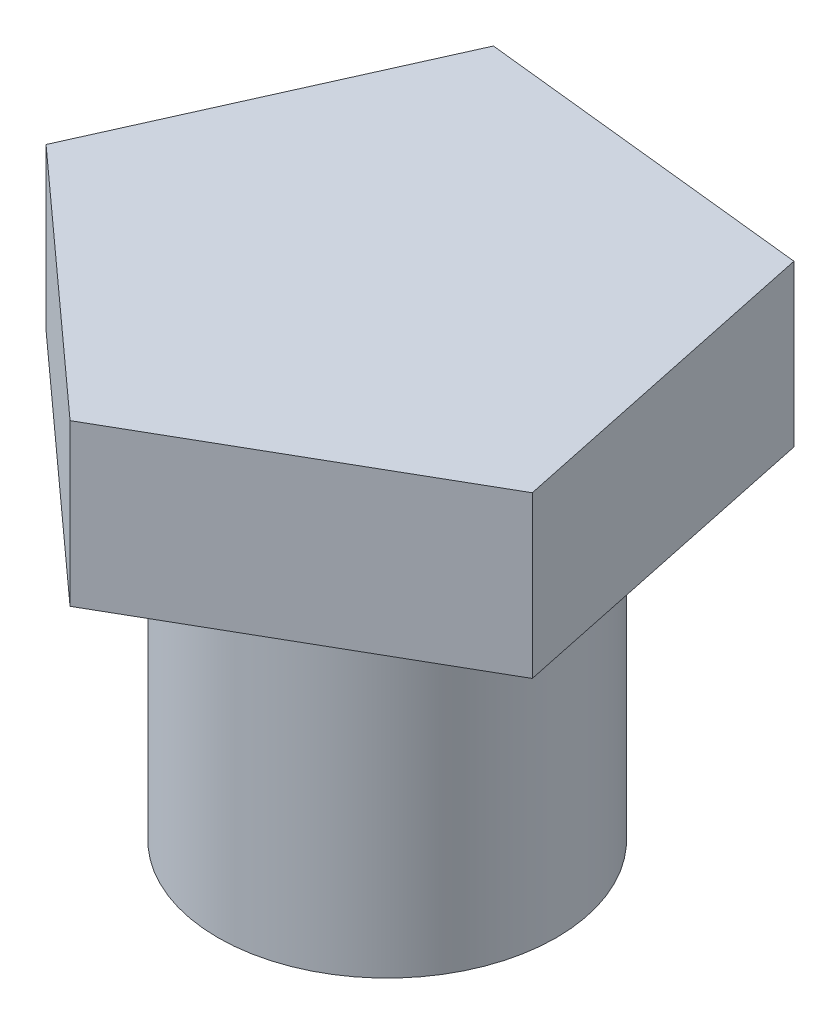
ISO-10303-21;
HEADER;
FILE_DESCRIPTION(('STEP AP214'),'2;1');
FILE_NAME('part.step','',(''),(''),'','','');
FILE_SCHEMA(('AUTOMOTIVE_DESIGN { 1 0 10303 214 1 1 1 1 }'));
ENDSEC;
DATA;
#1=APPLICATION_CONTEXT('core data for automotive mechanical design processes');
#2=APPLICATION_PROTOCOL_DEFINITION('international standard','automotive_design',2000,#1);
#3=PRODUCT_CONTEXT('',#1,'mechanical');
#4=PRODUCT('Part','Part','',(#3));
#5=PRODUCT_RELATED_PRODUCT_CATEGORY('part','',(#4));
#6=PRODUCT_DEFINITION_FORMATION('','',#4);
#7=PRODUCT_DEFINITION_CONTEXT('part definition',#1,'design');
#8=PRODUCT_DEFINITION('design','',#6,#7);
#9=PRODUCT_DEFINITION_SHAPE('','',#8);
#10=(LENGTH_UNIT() NAMED_UNIT(*) SI_UNIT(.MILLI.,.METRE.));
#11=(NAMED_UNIT(*) PLANE_ANGLE_UNIT() SI_UNIT($,.RADIAN.));
#12=(NAMED_UNIT(*) SI_UNIT($,.STERADIAN.) SOLID_ANGLE_UNIT());
#13=UNCERTAINTY_MEASURE_WITH_UNIT(LENGTH_MEASURE(1.E-05),#10,'distance_accuracy_value','');
#14=(GEOMETRIC_REPRESENTATION_CONTEXT(3) GLOBAL_UNCERTAINTY_ASSIGNED_CONTEXT((#13)) GLOBAL_UNIT_ASSIGNED_CONTEXT((#10,
#11,#12)) REPRESENTATION_CONTEXT('',''));
#15=CARTESIAN_POINT('',(0.,0.,0.));
#16=DIRECTION('',(0.,0.,1.));
#17=DIRECTION('',(1.,0.,0.));
#18=AXIS2_PLACEMENT_3D('',#15,#16,#17);
#19=CARTESIAN_POINT('',(0.,9.906,0.));
#20=DIRECTION('',(0.,-1.,0.));
#21=DIRECTION('',(0.,0.,-1.));
#22=AXIS2_PLACEMENT_3D('',#19,#20,#21);
#23=CYLINDRICAL_SURFACE('',#22,5.08);
#24=CARTESIAN_POINT('',(0.,9.906,0.));
#25=DIRECTION('',(0.,1.,0.));
#26=DIRECTION('',(0.,0.,1.));
#27=AXIS2_PLACEMENT_3D('',#24,#25,#26);
#28=CIRCLE('',#27,5.08);
#29=CARTESIAN_POINT('',(0.,9.906,5.08));
#30=VERTEX_POINT('',#29);
#31=EDGE_CURVE('E11',#30,#30,#28,.T.);
#32=ORIENTED_EDGE('',*,*,#31,.F.);
#33=EDGE_LOOP('',(#32));
#34=FACE_BOUND('',#33,.T.);
#35=CARTESIAN_POINT('',(0.,0.,0.));
#36=DIRECTION('',(0.,1.,0.));
#37=DIRECTION('',(0.,0.,1.));
#38=AXIS2_PLACEMENT_3D('',#35,#36,#37);
#39=CIRCLE('',#38,5.08);
#40=CARTESIAN_POINT('',(0.,0.,5.08));
#41=VERTEX_POINT('',#40);
#42=EDGE_CURVE('E48',#41,#41,#39,.T.);
#43=ORIENTED_EDGE('',*,*,#42,.T.);
#44=EDGE_LOOP('',(#43));
#45=FACE_BOUND('',#44,.T.);
#46=ADVANCED_FACE('F45',(#34,#45),#23,.T.);
#47=CARTESIAN_POINT('',(0.,0.,0.));
#48=DIRECTION('',(0.,1.,0.));
#49=DIRECTION('',(0.,0.,1.));
#50=AXIS2_PLACEMENT_3D('',#47,#48,#49);
#51=PLANE('',#50);
#52=ORIENTED_EDGE('',*,*,#42,.F.);
#53=EDGE_LOOP('',(#52));
#54=FACE_BOUND('',#53,.T.);
#55=ADVANCED_FACE('F154',(#54),#51,.F.);
#56=CARTESIAN_POINT('',(-0.922109231063126,14.732,8.59327995749053));
#57=DIRECTION('',(-0.498113427191519,0.,-0.867111880700247));
#58=DIRECTION('',(-0.867111880700247,0.,0.498113427191519));
#59=AXIS2_PLACEMENT_3D('',#56,#57,#58);
#60=PLANE('',#59);
#61=DIRECTION('',(0.867111880700247,0.,-0.498113427191519));
#62=VECTOR('',#61,1.);
#63=CARTESIAN_POINT('',(-0.922109231063126,9.906,8.59327995749053));
#64=LINE('',#63,#62);
#65=CARTESIAN_POINT('',(-0.922109231063126,9.906,8.59327995749053));
#66=VERTEX_POINT('',#65);
#67=CARTESIAN_POINT('',(7.88774747685139,9.906,3.5324475372247));
#68=VERTEX_POINT('',#67);
#69=EDGE_CURVE('E126',#66,#68,#64,.T.);
#70=ORIENTED_EDGE('',*,*,#69,.T.);
#71=DIRECTION('',(0.,-1.,0.));
#72=VECTOR('',#71,1.);
#73=CARTESIAN_POINT('',(7.88774747685139,14.732,3.5324475372247));
#74=LINE('',#73,#72);
#75=CARTESIAN_POINT('',(7.88774747685139,14.732,3.5324475372247));
#76=VERTEX_POINT('',#75);
#77=EDGE_CURVE('E146',#76,#68,#74,.T.);
#78=ORIENTED_EDGE('',*,*,#77,.F.);
#79=DIRECTION('',(0.867111880700247,0.,-0.498113427191519));
#80=VECTOR('',#79,1.);
#81=CARTESIAN_POINT('',(-0.922109231063126,14.732,8.59327995749053));
#82=LINE('',#81,#80);
#83=CARTESIAN_POINT('',(-0.922109231063126,14.732,8.59327995749053));
#84=VERTEX_POINT('',#83);
#85=EDGE_CURVE('E139',#84,#76,#82,.T.);
#86=ORIENTED_EDGE('',*,*,#85,.F.);
#87=DIRECTION('',(0.,-1.,0.));
#88=VECTOR('',#87,1.);
#89=CARTESIAN_POINT('',(-0.922109231063126,14.732,8.59327995749053));
#90=LINE('',#89,#88);
#91=EDGE_CURVE('E122',#84,#66,#90,.T.);
#92=ORIENTED_EDGE('',*,*,#91,.T.);
#93=EDGE_LOOP('',(#70,#78,#86,#92));
#94=FACE_BOUND('',#93,.T.);
#95=ADVANCED_FACE('F156',(#94),#60,.F.);
#96=CARTESIAN_POINT('',(7.88774747685139,14.732,3.5324475372247));
#97=DIRECTION('',(-0.978597918625443,0.,0.205781713623807));
#98=DIRECTION('',(0.205781713623807,0.,0.978597918625443));
#99=AXIS2_PLACEMENT_3D('',#96,#97,#98);
#100=PLANE('',#99);
#101=DIRECTION('',(-0.205781713623807,0.,-0.978597918625443));
#102=VECTOR('',#101,1.);
#103=CARTESIAN_POINT('',(7.88774747685139,9.906,3.5324475372247));
#104=LINE('',#103,#102);
#105=CARTESIAN_POINT('',(5.79700526643351,9.906,-6.4101073160098));
#106=VERTEX_POINT('',#105);
#107=EDGE_CURVE('E130',#68,#106,#104,.T.);
#108=ORIENTED_EDGE('',*,*,#107,.T.);
#109=DIRECTION('',(0.,-1.,0.));
#110=VECTOR('',#109,1.);
#111=CARTESIAN_POINT('',(5.79700526643351,14.732,-6.4101073160098));
#112=LINE('',#111,#110);
#113=CARTESIAN_POINT('',(5.79700526643351,14.732,-6.4101073160098));
#114=VERTEX_POINT('',#113);
#115=EDGE_CURVE('E115',#114,#106,#112,.T.);
#116=ORIENTED_EDGE('',*,*,#115,.F.);
#117=DIRECTION('',(-0.205781713623807,0.,-0.978597918625443));
#118=VECTOR('',#117,1.);
#119=CARTESIAN_POINT('',(7.88774747685139,14.732,3.5324475372247));
#120=LINE('',#119,#118);
#121=EDGE_CURVE('E97',#76,#114,#120,.T.);
#122=ORIENTED_EDGE('',*,*,#121,.F.);
#123=ORIENTED_EDGE('',*,*,#77,.T.);
#124=EDGE_LOOP('',(#108,#116,#122,#123));
#125=FACE_BOUND('',#124,.T.);
#126=ADVANCED_FACE('F161',(#125),#100,.F.);
#127=CARTESIAN_POINT('',(5.79700526643351,14.732,-6.4101073160098));
#128=DIRECTION('',(-0.106693347838909,0.,0.994291973982957));
#129=DIRECTION('',(0.994291973982957,0.,0.106693347838909));
#130=AXIS2_PLACEMENT_3D('',#127,#128,#129);
#131=PLANE('',#130);
#132=DIRECTION('',(-0.994291973982957,0.,-0.106693347838909));
#133=VECTOR('',#132,1.);
#134=CARTESIAN_POINT('',(5.79700526643351,9.906,-6.4101073160098));
#135=LINE('',#134,#133);
#136=CARTESIAN_POINT('',(-4.30500118923334,9.906,-7.49411173005312));
#137=VERTEX_POINT('',#136);
#138=EDGE_CURVE('E113',#106,#137,#135,.T.);
#139=ORIENTED_EDGE('',*,*,#138,.T.);
#140=DIRECTION('',(0.,-1.,0.));
#141=VECTOR('',#140,1.);
#142=CARTESIAN_POINT('',(-4.30500118923334,14.732,-7.49411173005312));
#143=LINE('',#142,#141);
#144=CARTESIAN_POINT('',(-4.30500118923334,14.732,-7.49411173005312));
#145=VERTEX_POINT('',#144);
#146=EDGE_CURVE('E110',#145,#137,#143,.T.);
#147=ORIENTED_EDGE('',*,*,#146,.F.);
#148=DIRECTION('',(-0.994291973982957,0.,-0.106693347838909));
#149=VECTOR('',#148,1.);
#150=CARTESIAN_POINT('',(5.79700526643351,14.732,-6.4101073160098));
#151=LINE('',#150,#149);
#152=EDGE_CURVE('E101',#114,#145,#151,.T.);
#153=ORIENTED_EDGE('',*,*,#152,.F.);
#154=ORIENTED_EDGE('',*,*,#115,.T.);
#155=EDGE_LOOP('',(#139,#147,#153,#154));
#156=FACE_BOUND('',#155,.T.);
#157=ADVANCED_FACE('F111',(#156),#131,.F.);
#158=CARTESIAN_POINT('',(-4.30500118923334,14.732,-7.49411173005312));
#159=DIRECTION('',(0.912657803287482,0.,0.408724521038887));
#160=DIRECTION('',(0.408724521038887,0.,-0.912657803287482));
#161=AXIS2_PLACEMENT_3D('',#158,#159,#160);
#162=PLANE('',#161);
#163=DIRECTION('',(-0.408724521038887,0.,0.912657803287482));
#164=VECTOR('',#163,1.);
#165=CARTESIAN_POINT('',(-4.30500118923334,9.906,-7.49411173005312));
#166=LINE('',#165,#164);
#167=CARTESIAN_POINT('',(-8.45764232298843,9.906,1.7784915513477));
#168=VERTEX_POINT('',#167);
#169=EDGE_CURVE('E82',#137,#168,#166,.T.);
#170=ORIENTED_EDGE('',*,*,#169,.T.);
#171=DIRECTION('',(0.,-1.,0.));
#172=VECTOR('',#171,1.);
#173=CARTESIAN_POINT('',(-8.45764232298843,14.732,1.7784915513477));
#174=LINE('',#173,#172);
#175=CARTESIAN_POINT('',(-8.45764232298843,14.732,1.7784915513477));
#176=VERTEX_POINT('',#175);
#177=EDGE_CURVE('E116',#176,#168,#174,.T.);
#178=ORIENTED_EDGE('',*,*,#177,.F.);
#179=DIRECTION('',(-0.408724521038887,0.,0.912657803287482));
#180=VECTOR('',#179,1.);
#181=CARTESIAN_POINT('',(-4.30500118923334,14.732,-7.49411173005312));
#182=LINE('',#181,#180);
#183=EDGE_CURVE('E105',#145,#176,#182,.T.);
#184=ORIENTED_EDGE('',*,*,#183,.F.);
#185=ORIENTED_EDGE('',*,*,#146,.T.);
#186=EDGE_LOOP('',(#170,#178,#184,#185));
#187=FACE_BOUND('',#186,.T.);
#188=ADVANCED_FACE('F118',(#187),#162,.F.);
#189=CARTESIAN_POINT('',(-8.45764232298843,14.732,1.7784915513477));
#190=DIRECTION('',(0.670746890368389,0.,-0.741686327945404));
#191=DIRECTION('',(-0.741686327945404,0.,-0.670746890368389));
#192=AXIS2_PLACEMENT_3D('',#189,#190,#191);
#193=PLANE('',#192);
#194=DIRECTION('',(0.741686327945404,0.,0.670746890368389));
#195=VECTOR('',#194,1.);
#196=CARTESIAN_POINT('',(-8.45764232298843,9.906,1.7784915513477));
#197=LINE('',#196,#195);
#198=EDGE_CURVE('E88',#168,#66,#197,.T.);
#199=ORIENTED_EDGE('',*,*,#198,.T.);
#200=ORIENTED_EDGE('',*,*,#91,.F.);
#201=DIRECTION('',(0.741686327945404,0.,0.670746890368389));
#202=VECTOR('',#201,1.);
#203=CARTESIAN_POINT('',(-8.45764232298843,14.732,1.7784915513477));
#204=LINE('',#203,#202);
#205=EDGE_CURVE('E62',#176,#84,#204,.T.);
#206=ORIENTED_EDGE('',*,*,#205,.F.);
#207=ORIENTED_EDGE('',*,*,#177,.T.);
#208=EDGE_LOOP('',(#199,#200,#206,#207));
#209=FACE_BOUND('',#208,.T.);
#210=ADVANCED_FACE('F172',(#209),#193,.F.);
#211=CARTESIAN_POINT('',(0.,14.732,0.));
#212=DIRECTION('',(0.,1.,0.));
#213=DIRECTION('',(0.,0.,1.));
#214=AXIS2_PLACEMENT_3D('',#211,#212,#213);
#215=PLANE('',#214);
#216=ORIENTED_EDGE('',*,*,#85,.T.);
#217=ORIENTED_EDGE('',*,*,#121,.T.);
#218=ORIENTED_EDGE('',*,*,#152,.T.);
#219=ORIENTED_EDGE('',*,*,#183,.T.);
#220=ORIENTED_EDGE('',*,*,#205,.T.);
#221=EDGE_LOOP('',(#216,#217,#218,#219,#220));
#222=FACE_BOUND('',#221,.T.);
#223=ADVANCED_FACE('F103',(#222),#215,.T.);
#224=CARTESIAN_POINT('',(0.,9.906,0.));
#225=DIRECTION('',(0.,1.,0.));
#226=DIRECTION('',(0.,0.,1.));
#227=AXIS2_PLACEMENT_3D('',#224,#225,#226);
#228=PLANE('',#227);
#229=ORIENTED_EDGE('',*,*,#31,.T.);
#230=EDGE_LOOP('',(#229));
#231=FACE_BOUND('',#230,.T.);
#232=ORIENTED_EDGE('',*,*,#69,.F.);
#233=ORIENTED_EDGE('',*,*,#198,.F.);
#234=ORIENTED_EDGE('',*,*,#169,.F.);
#235=ORIENTED_EDGE('',*,*,#138,.F.);
#236=ORIENTED_EDGE('',*,*,#107,.F.);
#237=EDGE_LOOP('',(#232,#233,#234,#235,#236));
#238=FACE_BOUND('',#237,.T.);
#239=ADVANCED_FACE('F175',(#231,#238),#228,.F.);
#240=CLOSED_SHELL('',(#46,#55,#95,#126,#157,#188,#210,#223,#239));
#241=MANIFOLD_SOLID_BREP('B2',#240);
#242=ADVANCED_BREP_SHAPE_REPRESENTATION('',(#18,#241),#14);
#243=SHAPE_DEFINITION_REPRESENTATION(#9,#242);
ENDSEC;
END-ISO-10303-21;
